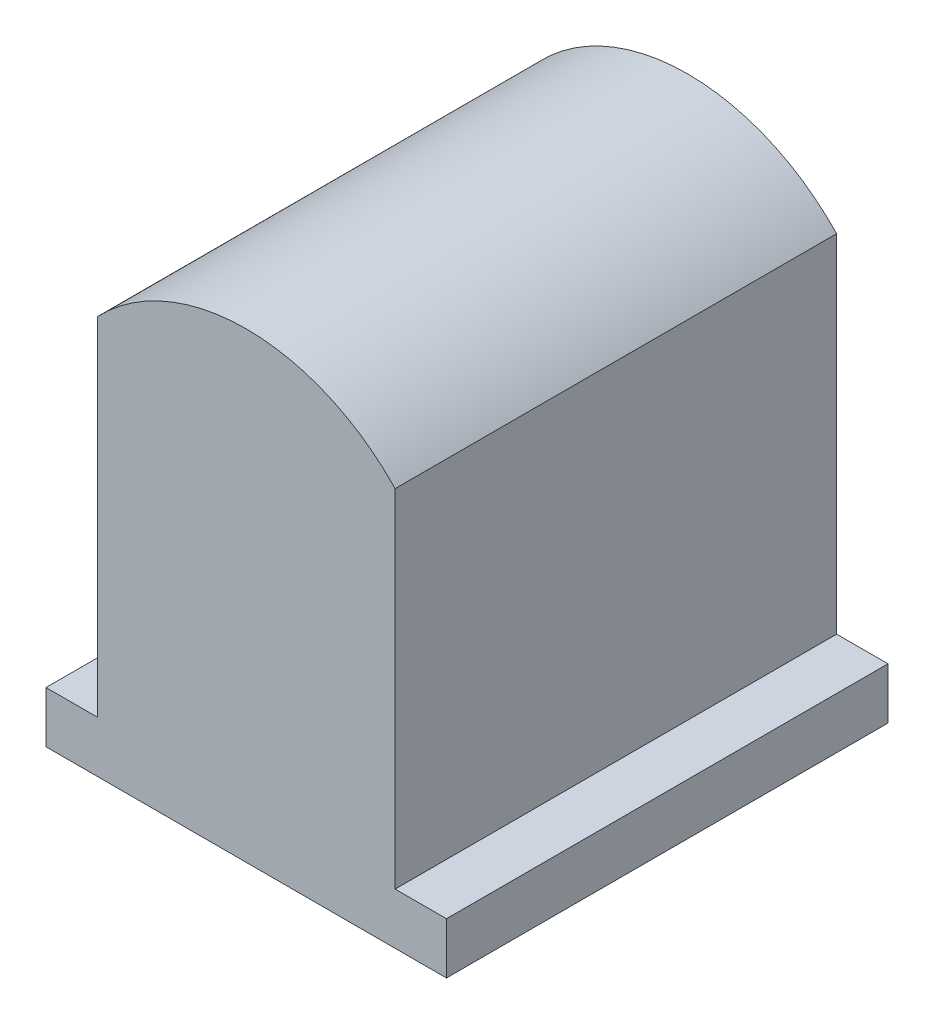
ISO-10303-21;
HEADER;
FILE_DESCRIPTION(('STEP AP214'),'2;1');
FILE_NAME('part.step','',(''),(''),'','','');
FILE_SCHEMA(('AUTOMOTIVE_DESIGN { 1 0 10303 214 1 1 1 1 }'));
ENDSEC;
DATA;
#1=APPLICATION_CONTEXT('core data for automotive mechanical design processes');
#2=APPLICATION_PROTOCOL_DEFINITION('international standard','automotive_design',2000,#1);
#3=PRODUCT_CONTEXT('',#1,'mechanical');
#4=PRODUCT('Part','Part','',(#3));
#5=PRODUCT_RELATED_PRODUCT_CATEGORY('part','',(#4));
#6=PRODUCT_DEFINITION_FORMATION('','',#4);
#7=PRODUCT_DEFINITION_CONTEXT('part definition',#1,'design');
#8=PRODUCT_DEFINITION('design','',#6,#7);
#9=PRODUCT_DEFINITION_SHAPE('','',#8);
#10=(LENGTH_UNIT() NAMED_UNIT(*) SI_UNIT(.MILLI.,.METRE.));
#11=(NAMED_UNIT(*) PLANE_ANGLE_UNIT() SI_UNIT($,.RADIAN.));
#12=(NAMED_UNIT(*) SI_UNIT($,.STERADIAN.) SOLID_ANGLE_UNIT());
#13=UNCERTAINTY_MEASURE_WITH_UNIT(LENGTH_MEASURE(1.E-05),#10,'distance_accuracy_value','');
#14=(GEOMETRIC_REPRESENTATION_CONTEXT(3) GLOBAL_UNCERTAINTY_ASSIGNED_CONTEXT((#13)) GLOBAL_UNIT_ASSIGNED_CONTEXT((#10,
#11,#12)) REPRESENTATION_CONTEXT('',''));
#15=CARTESIAN_POINT('',(0.,0.,0.));
#16=DIRECTION('',(0.,0.,1.));
#17=DIRECTION('',(1.,0.,0.));
#18=AXIS2_PLACEMENT_3D('',#15,#16,#17);
#19=CARTESIAN_POINT('',(0.,0.561251134302204,4.3));
#20=DIRECTION('',(0.,0.,-1.));
#21=DIRECTION('',(-1.,0.,0.));
#22=AXIS2_PLACEMENT_3D('',#19,#20,#21);
#23=CYLINDRICAL_SURFACE('',#22,2.);
#24=CARTESIAN_POINT('',(0.,0.561251134302204,0.));
#25=DIRECTION('',(0.,0.,1.));
#26=DIRECTION('',(-1.,0.,0.));
#27=AXIS2_PLACEMENT_3D('',#24,#25,#26);
#28=CIRCLE('',#27,2.);
#29=CARTESIAN_POINT('',(1.45,1.9387488656978,0.));
#30=VERTEX_POINT('',#29);
#31=CARTESIAN_POINT('',(-1.45,1.9387488656978,0.));
#32=VERTEX_POINT('',#31);
#33=EDGE_CURVE('E128',#30,#32,#28,.T.);
#34=ORIENTED_EDGE('',*,*,#33,.T.);
#35=DIRECTION('',(0.,0.,-1.));
#36=VECTOR('',#35,1.);
#37=CARTESIAN_POINT('',(-1.45,1.9387488656978,4.3));
#38=LINE('',#37,#36);
#39=CARTESIAN_POINT('',(-1.45,1.9387488656978,4.3));
#40=VERTEX_POINT('',#39);
#41=EDGE_CURVE('E11',#40,#32,#38,.T.);
#42=ORIENTED_EDGE('',*,*,#41,.F.);
#43=CARTESIAN_POINT('',(0.,0.561251134302204,4.3));
#44=DIRECTION('',(0.,0.,1.));
#45=DIRECTION('',(-1.,0.,0.));
#46=AXIS2_PLACEMENT_3D('',#43,#44,#45);
#47=CIRCLE('',#46,2.);
#48=CARTESIAN_POINT('',(1.45,1.9387488656978,4.3));
#49=VERTEX_POINT('',#48);
#50=EDGE_CURVE('E143',#49,#40,#47,.T.);
#51=ORIENTED_EDGE('',*,*,#50,.F.);
#52=DIRECTION('',(0.,0.,-1.));
#53=VECTOR('',#52,1.);
#54=CARTESIAN_POINT('',(1.45,1.9387488656978,4.3));
#55=LINE('',#54,#53);
#56=EDGE_CURVE('E124',#49,#30,#55,.T.);
#57=ORIENTED_EDGE('',*,*,#56,.T.);
#58=EDGE_LOOP('',(#34,#42,#51,#57));
#59=FACE_BOUND('',#58,.T.);
#60=ADVANCED_FACE('F32',(#59),#23,.T.);
#61=CARTESIAN_POINT('',(-1.45,-1.4387488656978,4.3));
#62=DIRECTION('',(1.,0.,0.));
#63=DIRECTION('',(0.,0.,-1.));
#64=AXIS2_PLACEMENT_3D('',#61,#62,#63);
#65=PLANE('',#64);
#66=DIRECTION('',(0.,-1.,0.));
#67=VECTOR('',#66,1.);
#68=CARTESIAN_POINT('',(-1.45,-1.4387488656978,0.));
#69=LINE('',#68,#67);
#70=CARTESIAN_POINT('',(-1.45,-1.4387488656978,0.));
#71=VERTEX_POINT('',#70);
#72=EDGE_CURVE('E131',#32,#71,#69,.T.);
#73=ORIENTED_EDGE('',*,*,#72,.T.);
#74=DIRECTION('',(0.,0.,-1.));
#75=VECTOR('',#74,1.);
#76=CARTESIAN_POINT('',(-1.45,-1.4387488656978,4.3));
#77=LINE('',#76,#75);
#78=CARTESIAN_POINT('',(-1.45,-1.4387488656978,4.3));
#79=VERTEX_POINT('',#78);
#80=EDGE_CURVE('E40',#79,#71,#77,.T.);
#81=ORIENTED_EDGE('',*,*,#80,.F.);
#82=DIRECTION('',(0.,-1.,0.));
#83=VECTOR('',#82,1.);
#84=CARTESIAN_POINT('',(-1.45,-1.4387488656978,4.3));
#85=LINE('',#84,#83);
#86=EDGE_CURVE('E91',#40,#79,#85,.T.);
#87=ORIENTED_EDGE('',*,*,#86,.F.);
#88=ORIENTED_EDGE('',*,*,#41,.T.);
#89=EDGE_LOOP('',(#73,#81,#87,#88));
#90=FACE_BOUND('',#89,.T.);
#91=ADVANCED_FACE('F177',(#90),#65,.F.);
#92=CARTESIAN_POINT('',(-1.45,-1.4387488656978,4.3));
#93=DIRECTION('',(0.,-1.,0.));
#94=DIRECTION('',(0.,0.,-1.));
#95=AXIS2_PLACEMENT_3D('',#92,#93,#94);
#96=PLANE('',#95);
#97=DIRECTION('',(-1.,0.,0.));
#98=VECTOR('',#97,1.);
#99=CARTESIAN_POINT('',(-1.45,-1.4387488656978,0.));
#100=LINE('',#99,#98);
#101=CARTESIAN_POINT('',(-1.95,-1.4387488656978,0.));
#102=VERTEX_POINT('',#101);
#103=EDGE_CURVE('E133',#71,#102,#100,.T.);
#104=ORIENTED_EDGE('',*,*,#103,.T.);
#105=DIRECTION('',(0.,0.,-1.));
#106=VECTOR('',#105,1.);
#107=CARTESIAN_POINT('',(-1.95,-1.4387488656978,4.3));
#108=LINE('',#107,#106);
#109=CARTESIAN_POINT('',(-1.95,-1.4387488656978,4.3));
#110=VERTEX_POINT('',#109);
#111=EDGE_CURVE('E150',#110,#102,#108,.T.);
#112=ORIENTED_EDGE('',*,*,#111,.F.);
#113=DIRECTION('',(-1.,0.,0.));
#114=VECTOR('',#113,1.);
#115=CARTESIAN_POINT('',(-1.45,-1.4387488656978,4.3));
#116=LINE('',#115,#114);
#117=EDGE_CURVE('E158',#79,#110,#116,.T.);
#118=ORIENTED_EDGE('',*,*,#117,.F.);
#119=ORIENTED_EDGE('',*,*,#80,.T.);
#120=EDGE_LOOP('',(#104,#112,#118,#119));
#121=FACE_BOUND('',#120,.T.);
#122=ADVANCED_FACE('F156',(#121),#96,.F.);
#123=CARTESIAN_POINT('',(-1.95,-1.4387488656978,4.3));
#124=DIRECTION('',(1.,0.,0.));
#125=DIRECTION('',(0.,0.,-1.));
#126=AXIS2_PLACEMENT_3D('',#123,#124,#125);
#127=PLANE('',#126);
#128=DIRECTION('',(0.,-1.,0.));
#129=VECTOR('',#128,1.);
#130=CARTESIAN_POINT('',(-1.95,-1.4387488656978,0.));
#131=LINE('',#130,#129);
#132=CARTESIAN_POINT('',(-1.95,-1.9387488656978,0.));
#133=VERTEX_POINT('',#132);
#134=EDGE_CURVE('E135',#102,#133,#131,.T.);
#135=ORIENTED_EDGE('',*,*,#134,.T.);
#136=DIRECTION('',(0.,0.,-1.));
#137=VECTOR('',#136,1.);
#138=CARTESIAN_POINT('',(-1.95,-1.9387488656978,4.3));
#139=LINE('',#138,#137);
#140=CARTESIAN_POINT('',(-1.95,-1.9387488656978,4.3));
#141=VERTEX_POINT('',#140);
#142=EDGE_CURVE('E147',#141,#133,#139,.T.);
#143=ORIENTED_EDGE('',*,*,#142,.F.);
#144=DIRECTION('',(0.,-1.,0.));
#145=VECTOR('',#144,1.);
#146=CARTESIAN_POINT('',(-1.95,-1.4387488656978,4.3));
#147=LINE('',#146,#145);
#148=EDGE_CURVE('E169',#110,#141,#147,.T.);
#149=ORIENTED_EDGE('',*,*,#148,.F.);
#150=ORIENTED_EDGE('',*,*,#111,.T.);
#151=EDGE_LOOP('',(#135,#143,#149,#150));
#152=FACE_BOUND('',#151,.T.);
#153=ADVANCED_FACE('F165',(#152),#127,.F.);
#154=CARTESIAN_POINT('',(1.95,-1.9387488656978,4.3));
#155=DIRECTION('',(0.,1.,0.));
#156=DIRECTION('',(0.,0.,1.));
#157=AXIS2_PLACEMENT_3D('',#154,#155,#156);
#158=PLANE('',#157);
#159=DIRECTION('',(1.,0.,0.));
#160=VECTOR('',#159,1.);
#161=CARTESIAN_POINT('',(1.95,-1.9387488656978,0.));
#162=LINE('',#161,#160);
#163=CARTESIAN_POINT('',(1.95,-1.9387488656978,0.));
#164=VERTEX_POINT('',#163);
#165=EDGE_CURVE('E138',#133,#164,#162,.T.);
#166=ORIENTED_EDGE('',*,*,#165,.T.);
#167=DIRECTION('',(0.,0.,-1.));
#168=VECTOR('',#167,1.);
#169=CARTESIAN_POINT('',(1.95,-1.9387488656978,4.3));
#170=LINE('',#169,#168);
#171=CARTESIAN_POINT('',(1.95,-1.9387488656978,4.3));
#172=VERTEX_POINT('',#171);
#173=EDGE_CURVE('E119',#172,#164,#170,.T.);
#174=ORIENTED_EDGE('',*,*,#173,.F.);
#175=DIRECTION('',(1.,0.,0.));
#176=VECTOR('',#175,1.);
#177=CARTESIAN_POINT('',(-1.95,-1.9387488656978,4.3));
#178=LINE('',#177,#176);
#179=EDGE_CURVE('E110',#141,#172,#178,.T.);
#180=ORIENTED_EDGE('',*,*,#179,.F.);
#181=ORIENTED_EDGE('',*,*,#142,.T.);
#182=EDGE_LOOP('',(#166,#174,#180,#181));
#183=FACE_BOUND('',#182,.T.);
#184=ADVANCED_FACE('F168',(#183),#158,.F.);
#185=CARTESIAN_POINT('',(1.95,-1.43874886569779,4.3));
#186=DIRECTION('',(-1.,0.,0.));
#187=DIRECTION('',(0.,0.,1.));
#188=AXIS2_PLACEMENT_3D('',#185,#186,#187);
#189=PLANE('',#188);
#190=DIRECTION('',(0.,1.,0.));
#191=VECTOR('',#190,1.);
#192=CARTESIAN_POINT('',(1.95,-1.43874886569779,0.));
#193=LINE('',#192,#191);
#194=CARTESIAN_POINT('',(1.95,-1.43874886569779,0.));
#195=VERTEX_POINT('',#194);
#196=EDGE_CURVE('E118',#164,#195,#193,.T.);
#197=ORIENTED_EDGE('',*,*,#196,.T.);
#198=DIRECTION('',(0.,0.,-1.));
#199=VECTOR('',#198,1.);
#200=CARTESIAN_POINT('',(1.95,-1.43874886569779,4.3));
#201=LINE('',#200,#199);
#202=CARTESIAN_POINT('',(1.95,-1.43874886569779,4.3));
#203=VERTEX_POINT('',#202);
#204=EDGE_CURVE('E115',#203,#195,#201,.T.);
#205=ORIENTED_EDGE('',*,*,#204,.F.);
#206=DIRECTION('',(0.,1.,0.));
#207=VECTOR('',#206,1.);
#208=CARTESIAN_POINT('',(1.95,-1.43874886569779,4.3));
#209=LINE('',#208,#207);
#210=EDGE_CURVE('E104',#172,#203,#209,.T.);
#211=ORIENTED_EDGE('',*,*,#210,.F.);
#212=ORIENTED_EDGE('',*,*,#173,.T.);
#213=EDGE_LOOP('',(#197,#205,#211,#212));
#214=FACE_BOUND('',#213,.T.);
#215=ADVANCED_FACE('F116',(#214),#189,.F.);
#216=CARTESIAN_POINT('',(1.45,-1.4387488656978,4.3));
#217=DIRECTION('',(0.,-1.,0.));
#218=DIRECTION('',(1.,0.,0.));
#219=AXIS2_PLACEMENT_3D('',#216,#217,#218);
#220=PLANE('',#219);
#221=DIRECTION('',(-1.,0.,0.));
#222=VECTOR('',#221,1.);
#223=CARTESIAN_POINT('',(1.45,-1.4387488656978,0.));
#224=LINE('',#223,#222);
#225=CARTESIAN_POINT('',(1.45,-1.4387488656978,0.));
#226=VERTEX_POINT('',#225);
#227=EDGE_CURVE('E77',#195,#226,#224,.T.);
#228=ORIENTED_EDGE('',*,*,#227,.T.);
#229=DIRECTION('',(0.,0.,-1.));
#230=VECTOR('',#229,1.);
#231=CARTESIAN_POINT('',(1.45,-1.4387488656978,4.3));
#232=LINE('',#231,#230);
#233=CARTESIAN_POINT('',(1.45,-1.4387488656978,4.3));
#234=VERTEX_POINT('',#233);
#235=EDGE_CURVE('E120',#234,#226,#232,.T.);
#236=ORIENTED_EDGE('',*,*,#235,.F.);
#237=DIRECTION('',(-1.,0.,0.));
#238=VECTOR('',#237,1.);
#239=CARTESIAN_POINT('',(1.45,-1.4387488656978,4.3));
#240=LINE('',#239,#238);
#241=EDGE_CURVE('E108',#203,#234,#240,.T.);
#242=ORIENTED_EDGE('',*,*,#241,.F.);
#243=ORIENTED_EDGE('',*,*,#204,.T.);
#244=EDGE_LOOP('',(#228,#236,#242,#243));
#245=FACE_BOUND('',#244,.T.);
#246=ADVANCED_FACE('F122',(#245),#220,.F.);
#247=CARTESIAN_POINT('',(1.45,-1.4387488656978,4.3));
#248=DIRECTION('',(-1.,0.,0.));
#249=DIRECTION('',(0.,0.,1.));
#250=AXIS2_PLACEMENT_3D('',#247,#248,#249);
#251=PLANE('',#250);
#252=DIRECTION('',(0.,1.,0.));
#253=VECTOR('',#252,1.);
#254=CARTESIAN_POINT('',(1.45,-1.4387488656978,0.));
#255=LINE('',#254,#253);
#256=EDGE_CURVE('E83',#226,#30,#255,.T.);
#257=ORIENTED_EDGE('',*,*,#256,.T.);
#258=ORIENTED_EDGE('',*,*,#56,.F.);
#259=DIRECTION('',(0.,1.,0.));
#260=VECTOR('',#259,1.);
#261=CARTESIAN_POINT('',(1.45,-1.4387488656978,4.3));
#262=LINE('',#261,#260);
#263=EDGE_CURVE('E48',#234,#49,#262,.T.);
#264=ORIENTED_EDGE('',*,*,#263,.F.);
#265=ORIENTED_EDGE('',*,*,#235,.T.);
#266=EDGE_LOOP('',(#257,#258,#264,#265));
#267=FACE_BOUND('',#266,.T.);
#268=ADVANCED_FACE('F193',(#267),#251,.F.);
#269=CARTESIAN_POINT('',(0.,0.561251134302204,4.3));
#270=DIRECTION('',(0.,0.,-1.));
#271=DIRECTION('',(-1.,0.,0.));
#272=AXIS2_PLACEMENT_3D('',#269,#270,#271);
#273=PLANE('',#272);
#274=ORIENTED_EDGE('',*,*,#50,.T.);
#275=ORIENTED_EDGE('',*,*,#86,.T.);
#276=ORIENTED_EDGE('',*,*,#117,.T.);
#277=ORIENTED_EDGE('',*,*,#148,.T.);
#278=ORIENTED_EDGE('',*,*,#179,.T.);
#279=ORIENTED_EDGE('',*,*,#210,.T.);
#280=ORIENTED_EDGE('',*,*,#241,.T.);
#281=ORIENTED_EDGE('',*,*,#263,.T.);
#282=EDGE_LOOP('',(#274,#275,#276,#277,#278,#279,#280,#281));
#283=FACE_BOUND('',#282,.T.);
#284=ADVANCED_FACE('F106',(#283),#273,.F.);
#285=CARTESIAN_POINT('',(0.,0.561251134302204,0.));
#286=DIRECTION('',(0.,0.,-1.));
#287=DIRECTION('',(-1.,0.,0.));
#288=AXIS2_PLACEMENT_3D('',#285,#286,#287);
#289=PLANE('',#288);
#290=ORIENTED_EDGE('',*,*,#33,.F.);
#291=ORIENTED_EDGE('',*,*,#256,.F.);
#292=ORIENTED_EDGE('',*,*,#227,.F.);
#293=ORIENTED_EDGE('',*,*,#196,.F.);
#294=ORIENTED_EDGE('',*,*,#165,.F.);
#295=ORIENTED_EDGE('',*,*,#134,.F.);
#296=ORIENTED_EDGE('',*,*,#103,.F.);
#297=ORIENTED_EDGE('',*,*,#72,.F.);
#298=EDGE_LOOP('',(#290,#291,#292,#293,#294,#295,#296,#297));
#299=FACE_BOUND('',#298,.T.);
#300=ADVANCED_FACE('F162',(#299),#289,.T.);
#301=CLOSED_SHELL('',(#60,#91,#122,#153,#184,#215,#246,#268,#284,#300));
#302=MANIFOLD_SOLID_BREP('B2',#301);
#303=ADVANCED_BREP_SHAPE_REPRESENTATION('',(#18,#302),#14);
#304=SHAPE_DEFINITION_REPRESENTATION(#9,#303);
ENDSEC;
END-ISO-10303-21;
